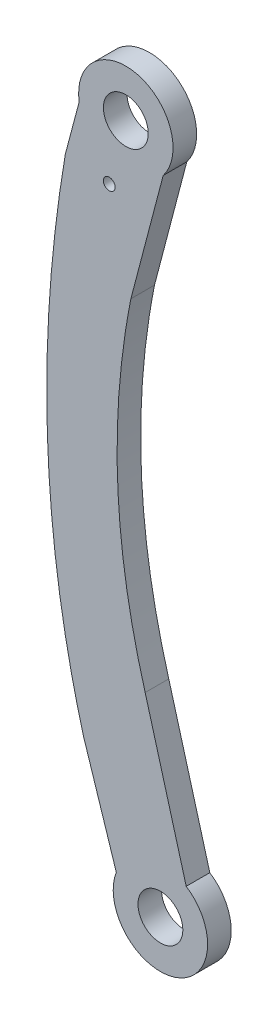
ISO-10303-21;
HEADER;
FILE_DESCRIPTION(('STEP AP214'),'2;1');
FILE_NAME('part.step','',(''),(''),'','','');
FILE_SCHEMA(('AUTOMOTIVE_DESIGN { 1 0 10303 214 1 1 1 1 }'));
ENDSEC;
DATA;
#1=APPLICATION_CONTEXT('core data for automotive mechanical design processes');
#2=APPLICATION_PROTOCOL_DEFINITION('international standard','automotive_design',2000,#1);
#3=PRODUCT_CONTEXT('',#1,'mechanical');
#4=PRODUCT('Part','Part','',(#3));
#5=PRODUCT_RELATED_PRODUCT_CATEGORY('part','',(#4));
#6=PRODUCT_DEFINITION_FORMATION('','',#4);
#7=PRODUCT_DEFINITION_CONTEXT('part definition',#1,'design');
#8=PRODUCT_DEFINITION('design','',#6,#7);
#9=PRODUCT_DEFINITION_SHAPE('','',#8);
#10=(LENGTH_UNIT() NAMED_UNIT(*) SI_UNIT(.MILLI.,.METRE.));
#11=(NAMED_UNIT(*) PLANE_ANGLE_UNIT() SI_UNIT($,.RADIAN.));
#12=(NAMED_UNIT(*) SI_UNIT($,.STERADIAN.) SOLID_ANGLE_UNIT());
#13=UNCERTAINTY_MEASURE_WITH_UNIT(LENGTH_MEASURE(1.E-05),#10,'distance_accuracy_value','');
#14=(GEOMETRIC_REPRESENTATION_CONTEXT(3) GLOBAL_UNCERTAINTY_ASSIGNED_CONTEXT((#13)) GLOBAL_UNIT_ASSIGNED_CONTEXT((#10,
#11,#12)) REPRESENTATION_CONTEXT('',''));
#15=CARTESIAN_POINT('',(0.,0.,0.));
#16=DIRECTION('',(0.,0.,1.));
#17=DIRECTION('',(1.,0.,0.));
#18=AXIS2_PLACEMENT_3D('',#15,#16,#17);
#19=CARTESIAN_POINT('',(-1.78802909142635,0.469897368259502,2.));
#20=DIRECTION('',(0.967159231454294,-0.254171243481122,0.));
#21=DIRECTION('',(0.254171243481122,0.967159231454294,0.));
#22=AXIS2_PLACEMENT_3D('',#19,#20,#21);
#23=PLANE('',#22);
#24=DIRECTION('',(-0.254171243481122,-0.967159231454294,0.));
#25=VECTOR('',#24,1.);
#26=CARTESIAN_POINT('',(-1.78802909142635,0.469897368259502,-2.));
#27=LINE('',#26,#25);
#28=CARTESIAN_POINT('',(0.470383738762236,9.06349272246381,-2.));
#29=VERTEX_POINT('',#28);
#30=CARTESIAN_POINT('',(-5.00419326786642,-11.7680837287156,-2.));
#31=VERTEX_POINT('',#30);
#32=EDGE_CURVE('E55',#29,#31,#27,.T.);
#33=ORIENTED_EDGE('',*,*,#32,.F.);
#34=DIRECTION('',(0.,0.,-1.));
#35=VECTOR('',#34,1.);
#36=CARTESIAN_POINT('',(0.47038373876223,9.0634927224638,2.));
#37=LINE('',#36,#35);
#38=CARTESIAN_POINT('',(0.470383738762236,9.06349272246381,2.));
#39=VERTEX_POINT('',#38);
#40=EDGE_CURVE('E50',#29,#39,#37,.F.);
#41=ORIENTED_EDGE('',*,*,#40,.T.);
#42=DIRECTION('',(-0.254171243481122,-0.967159231454294,0.));
#43=VECTOR('',#42,1.);
#44=CARTESIAN_POINT('',(-1.78802909142635,0.469897368259502,2.));
#45=LINE('',#44,#43);
#46=CARTESIAN_POINT('',(-5.00419326786642,-11.7680837287156,2.));
#47=VERTEX_POINT('',#46);
#48=EDGE_CURVE('E108',#39,#47,#45,.T.);
#49=ORIENTED_EDGE('',*,*,#48,.T.);
#50=DIRECTION('',(0.,0.,-1.));
#51=VECTOR('',#50,1.);
#52=CARTESIAN_POINT('',(-5.00419326786642,-11.7680837287156,2.));
#53=LINE('',#52,#51);
#54=EDGE_CURVE('E43',#47,#31,#53,.T.);
#55=ORIENTED_EDGE('',*,*,#54,.T.);
#56=EDGE_LOOP('',(#33,#41,#49,#55));
#57=FACE_BOUND('',#56,.T.);
#58=ADVANCED_FACE('F35',(#57),#23,.T.);
#59=CARTESIAN_POINT('',(-16.0185654022717,4.24957374531499,2.));
#60=DIRECTION('',(0.966565292689048,-0.256420621185064,0.));
#61=DIRECTION('',(0.256420621185064,0.966565292689048,0.));
#62=AXIS2_PLACEMENT_3D('',#59,#60,#61);
#63=PLANE('',#62);
#64=DIRECTION('',(0.,0.,-1.));
#65=VECTOR('',#64,1.);
#66=CARTESIAN_POINT('',(-13.7648884417375,12.7447014808224,2.));
#67=LINE('',#66,#65);
#68=CARTESIAN_POINT('',(-13.7648884417375,12.7447014808224,-2.));
#69=VERTEX_POINT('',#68);
#70=CARTESIAN_POINT('',(-13.7648884417375,12.7447014808224,2.));
#71=VERTEX_POINT('',#70);
#72=EDGE_CURVE('E99',#69,#71,#67,.F.);
#73=ORIENTED_EDGE('',*,*,#72,.F.);
#74=DIRECTION('',(-0.256420621185064,-0.966565292689048,0.));
#75=VECTOR('',#74,1.);
#76=CARTESIAN_POINT('',(-16.0185654022717,4.24957374531499,-2.));
#77=LINE('',#76,#75);
#78=CARTESIAN_POINT('',(-16.1090040902011,3.90866942777225,-2.));
#79=VERTEX_POINT('',#78);
#80=EDGE_CURVE('E270',#69,#79,#77,.T.);
#81=ORIENTED_EDGE('',*,*,#80,.T.);
#82=DIRECTION('',(0.,0.,-1.));
#83=VECTOR('',#82,1.);
#84=CARTESIAN_POINT('',(-16.1090040902011,3.90866942777225,2.));
#85=LINE('',#84,#83);
#86=CARTESIAN_POINT('',(-16.1090040902011,3.90866942777225,2.));
#87=VERTEX_POINT('',#86);
#88=EDGE_CURVE('E102',#87,#79,#85,.T.);
#89=ORIENTED_EDGE('',*,*,#88,.F.);
#90=DIRECTION('',(-0.256420621185064,-0.966565292689048,0.));
#91=VECTOR('',#90,1.);
#92=CARTESIAN_POINT('',(-16.0185654022717,4.24957374531499,2.));
#93=LINE('',#92,#91);
#94=EDGE_CURVE('E96',#71,#87,#93,.T.);
#95=ORIENTED_EDGE('',*,*,#94,.F.);
#96=EDGE_LOOP('',(#73,#81,#89,#95));
#97=FACE_BOUND('',#96,.T.);
#98=ADVANCED_FACE('F98',(#97),#63,.F.);
#99=CARTESIAN_POINT('',(-20.0645430802818,-5.59029489231509,2.));
#100=DIRECTION('',(0.963309485971728,0.268393059218909,0.));
#101=DIRECTION('',(-0.268393059218909,0.963309485971728,0.));
#102=AXIS2_PLACEMENT_3D('',#99,#100,#101);
#103=PLANE('',#102);
#104=DIRECTION('',(0.268393059218909,-0.963309485971728,0.));
#105=VECTOR('',#104,1.);
#106=CARTESIAN_POINT('',(-20.0645430802818,-5.59029489231509,2.));
#107=LINE('',#106,#105);
#108=CARTESIAN_POINT('',(-2.58265982047225,-68.3358220152404,2.));
#109=VERTEX_POINT('',#108);
#110=CARTESIAN_POINT('',(4.37302791285559,-93.3009980688685,2.));
#111=VERTEX_POINT('',#110);
#112=EDGE_CURVE('E139',#109,#111,#107,.T.);
#113=ORIENTED_EDGE('',*,*,#112,.T.);
#114=DIRECTION('',(0.,0.,-1.));
#115=VECTOR('',#114,1.);
#116=CARTESIAN_POINT('',(4.37302791285558,-93.3009980688685,2.));
#117=LINE('',#116,#115);
#118=CARTESIAN_POINT('',(4.37302791285559,-93.3009980688685,-2.));
#119=VERTEX_POINT('',#118);
#120=EDGE_CURVE('E133',#111,#119,#117,.T.);
#121=ORIENTED_EDGE('',*,*,#120,.T.);
#122=DIRECTION('',(0.268393059218909,-0.963309485971728,0.));
#123=VECTOR('',#122,1.);
#124=CARTESIAN_POINT('',(-20.0645430802818,-5.59029489231509,-2.));
#125=LINE('',#124,#123);
#126=CARTESIAN_POINT('',(-2.58265982047225,-68.3358220152404,-2.));
#127=VERTEX_POINT('',#126);
#128=EDGE_CURVE('E258',#127,#119,#125,.T.);
#129=ORIENTED_EDGE('',*,*,#128,.F.);
#130=DIRECTION('',(0.,0.,-1.));
#131=VECTOR('',#130,1.);
#132=CARTESIAN_POINT('',(-2.58265982047225,-68.3358220152404,2.));
#133=LINE('',#132,#131);
#134=EDGE_CURVE('E11',#109,#127,#133,.T.);
#135=ORIENTED_EDGE('',*,*,#134,.F.);
#136=EDGE_LOOP('',(#113,#121,#129,#135));
#137=FACE_BOUND('',#136,.T.);
#138=ADVANCED_FACE('F158',(#137),#103,.T.);
#139=CARTESIAN_POINT('',(-35.2130828693191,-11.3875475888114,2.));
#140=DIRECTION('',(-0.951483449346962,-0.307699927882356,0.));
#141=DIRECTION('',(0.307699927882356,-0.951483449346962,0.));
#142=AXIS2_PLACEMENT_3D('',#139,#140,#141);
#143=PLANE('',#142);
#144=DIRECTION('',(-0.307699927882356,0.951483449346962,0.));
#145=VECTOR('',#144,1.);
#146=CARTESIAN_POINT('',(-35.2130828693191,-11.3875475888114,-2.));
#147=LINE('',#146,#145);
#148=CARTESIAN_POINT('',(-7.47689148061421,-97.1546364402668,-2.));
#149=VERTEX_POINT('',#148);
#150=CARTESIAN_POINT('',(-13.0270199851385,-79.9922813817283,-2.));
#151=VERTEX_POINT('',#150);
#152=EDGE_CURVE('E277',#149,#151,#147,.T.);
#153=ORIENTED_EDGE('',*,*,#152,.F.);
#154=DIRECTION('',(0.,0.,-1.));
#155=VECTOR('',#154,1.);
#156=CARTESIAN_POINT('',(-7.47689148061421,-97.1546364402668,2.));
#157=LINE('',#156,#155);
#158=CARTESIAN_POINT('',(-7.47689148061421,-97.1546364402668,2.));
#159=VERTEX_POINT('',#158);
#160=EDGE_CURVE('E129',#149,#159,#157,.F.);
#161=ORIENTED_EDGE('',*,*,#160,.T.);
#162=DIRECTION('',(-0.307699927882356,0.951483449346962,0.));
#163=VECTOR('',#162,1.);
#164=CARTESIAN_POINT('',(-35.2130828693191,-11.3875475888114,2.));
#165=LINE('',#164,#163);
#166=CARTESIAN_POINT('',(-13.0270199851385,-79.9922813817283,2.));
#167=VERTEX_POINT('',#166);
#168=EDGE_CURVE('E244',#159,#167,#165,.T.);
#169=ORIENTED_EDGE('',*,*,#168,.T.);
#170=DIRECTION('',(0.,0.,-1.));
#171=VECTOR('',#170,1.);
#172=CARTESIAN_POINT('',(-13.0270199851385,-79.9922813817283,2.));
#173=LINE('',#172,#171);
#174=EDGE_CURVE('E255',#167,#151,#173,.T.);
#175=ORIENTED_EDGE('',*,*,#174,.T.);
#176=EDGE_LOOP('',(#153,#161,#169,#175));
#177=FACE_BOUND('',#176,.T.);
#178=ADVANCED_FACE('F155',(#177),#143,.T.);
#179=CARTESIAN_POINT('',(-2.58265982047225,-68.3358220152404,2.));
#180=CARTESIAN_POINT('',(-10.6774419006202,-40.319817229844,2.));
#181=CARTESIAN_POINT('',(-5.00419326786643,-11.7680837287156,2.));
#182=B_SPLINE_CURVE_WITH_KNOTS('',2,(#179,#180,#181),.UNSPECIFIED.,.F.,.F.,(3,3),(0.,1.),.UNSPECIFIED.);
#183=DIRECTION('',(0.,0.,-1.));
#184=VECTOR('',#183,1.);
#185=SURFACE_OF_LINEAR_EXTRUSION('',#182,#184);
#186=CARTESIAN_POINT('',(-2.58265982047225,-68.3358220152404,-2.));
#187=CARTESIAN_POINT('',(-10.6774419006202,-40.319817229844,-2.));
#188=CARTESIAN_POINT('',(-5.00419326786643,-11.7680837287156,-2.));
#189=B_SPLINE_CURVE_WITH_KNOTS('',2,(#186,#187,#188),.UNSPECIFIED.,.F.,.F.,(3,3),(0.,1.),.UNSPECIFIED.);
#190=EDGE_CURVE('E261',#127,#31,#189,.T.);
#191=ORIENTED_EDGE('',*,*,#190,.T.);
#192=ORIENTED_EDGE('',*,*,#54,.F.);
#193=EDGE_CURVE('E142',#109,#47,#182,.T.);
#194=ORIENTED_EDGE('',*,*,#193,.F.);
#195=ORIENTED_EDGE('',*,*,#134,.T.);
#196=EDGE_LOOP('',(#191,#192,#194,#195));
#197=FACE_BOUND('',#196,.T.);
#198=ADVANCED_FACE('F151',(#197),#185,.F.);
#199=CARTESIAN_POINT('',(-16.1090040902011,3.90866942777225,2.));
#200=CARTESIAN_POINT('',(-19.3777168344272,-15.2425089610822,2.));
#201=CARTESIAN_POINT('',(-20.6460852707623,-43.8019233774835,2.));
#202=CARTESIAN_POINT('',(-15.357286602361,-71.5641241934527,2.));
#203=CARTESIAN_POINT('',(-13.0270199851385,-79.9922813817283,2.));
#204=B_SPLINE_CURVE_WITH_KNOTS('',3,(#199,#200,#201,#202,#203),.UNSPECIFIED.,.F.,.F.,(4,1,4),
(0.,0.615830564355695,0.89175385418048),.UNSPECIFIED.);
#205=DIRECTION('',(0.,0.,-1.));
#206=VECTOR('',#205,1.);
#207=SURFACE_OF_LINEAR_EXTRUSION('',#204,#206);
#208=CARTESIAN_POINT('',(-16.1090040902011,3.90866942777225,-2.));
#209=CARTESIAN_POINT('',(-19.3777168344272,-15.2425089610822,-2.));
#210=CARTESIAN_POINT('',(-20.6460852707623,-43.8019233774835,-2.));
#211=CARTESIAN_POINT('',(-15.357286602361,-71.5641241934527,-2.));
#212=CARTESIAN_POINT('',(-13.0270199851385,-79.9922813817283,-2.));
#213=B_SPLINE_CURVE_WITH_KNOTS('',3,(#208,#209,#210,#211,#212),.UNSPECIFIED.,.F.,.F.,(4,1,4),
(0.,0.615830564355695,0.89175385418048),.UNSPECIFIED.);
#214=EDGE_CURVE('E272',#79,#151,#213,.T.);
#215=ORIENTED_EDGE('',*,*,#214,.T.);
#216=ORIENTED_EDGE('',*,*,#174,.F.);
#217=EDGE_CURVE('E107',#87,#167,#204,.T.);
#218=ORIENTED_EDGE('',*,*,#217,.F.);
#219=ORIENTED_EDGE('',*,*,#88,.T.);
#220=EDGE_LOOP('',(#215,#216,#218,#219));
#221=FACE_BOUND('',#220,.T.);
#222=ADVANCED_FACE('F154',(#221),#207,.F.);
#223=CARTESIAN_POINT('',(-5.85746323449391,13.9582197509153,2.));
#224=DIRECTION('',(0.,0.,-1.));
#225=DIRECTION('',(-1.,0.,0.));
#226=AXIS2_PLACEMENT_3D('',#223,#224,#225);
#227=CYLINDRICAL_SURFACE('',#226,3.8);
#228=CARTESIAN_POINT('',(-5.85746323449391,13.9582197509153,2.));
#229=DIRECTION('',(0.,0.,1.));
#230=DIRECTION('',(1.,0.,0.));
#231=AXIS2_PLACEMENT_3D('',#228,#229,#230);
#232=CIRCLE('',#231,3.8);
#233=CARTESIAN_POINT('',(-2.05746323449391,13.9582197509153,2.));
#234=VERTEX_POINT('',#233);
#235=EDGE_CURVE('E249',#234,#234,#232,.T.);
#236=ORIENTED_EDGE('',*,*,#235,.T.);
#237=EDGE_LOOP('',(#236));
#238=FACE_BOUND('',#237,.T.);
#239=CARTESIAN_POINT('',(-5.85746323449391,13.9582197509153,-2.));
#240=DIRECTION('',(0.,0.,1.));
#241=DIRECTION('',(1.,0.,0.));
#242=AXIS2_PLACEMENT_3D('',#239,#240,#241);
#243=CIRCLE('',#242,3.8);
#244=CARTESIAN_POINT('',(-2.05746323449391,13.9582197509153,-2.));
#245=VERTEX_POINT('',#244);
#246=EDGE_CURVE('E282',#245,#245,#243,.T.);
#247=ORIENTED_EDGE('',*,*,#246,.F.);
#248=EDGE_LOOP('',(#247));
#249=FACE_BOUND('',#248,.T.);
#250=ADVANCED_FACE('F233',(#238,#249),#227,.F.);
#251=CARTESIAN_POINT('',(-8.67203901594341,3.2483477044386,2.));
#252=DIRECTION('',(0.,0.,-1.));
#253=DIRECTION('',(-1.,0.,0.));
#254=AXIS2_PLACEMENT_3D('',#251,#252,#253);
#255=CYLINDRICAL_SURFACE('',#254,1.);
#256=CARTESIAN_POINT('',(-8.67203901594341,3.2483477044386,2.));
#257=DIRECTION('',(0.,0.,1.));
#258=DIRECTION('',(1.,0.,0.));
#259=AXIS2_PLACEMENT_3D('',#256,#257,#258);
#260=CIRCLE('',#259,1.);
#261=CARTESIAN_POINT('',(-7.67203901594341,3.2483477044386,2.));
#262=VERTEX_POINT('',#261);
#263=EDGE_CURVE('E136',#262,#262,#260,.T.);
#264=ORIENTED_EDGE('',*,*,#263,.T.);
#265=EDGE_LOOP('',(#264));
#266=FACE_BOUND('',#265,.T.);
#267=CARTESIAN_POINT('',(-8.67203901594341,3.2483477044386,-2.));
#268=DIRECTION('',(0.,0.,1.));
#269=DIRECTION('',(1.,0.,0.));
#270=AXIS2_PLACEMENT_3D('',#267,#268,#269);
#271=CIRCLE('',#270,1.);
#272=CARTESIAN_POINT('',(-7.67203901594341,3.2483477044386,-2.));
#273=VERTEX_POINT('',#272);
#274=EDGE_CURVE('E135',#273,#273,#271,.T.);
#275=ORIENTED_EDGE('',*,*,#274,.F.);
#276=EDGE_LOOP('',(#275));
#277=FACE_BOUND('',#276,.T.);
#278=ADVANCED_FACE('F37',(#266,#277),#255,.F.);
#279=CARTESIAN_POINT('',(1.40512601554121E-12,-100.000000000007,2.));
#280=DIRECTION('',(0.,0.,-1.));
#281=DIRECTION('',(-1.,0.,0.));
#282=AXIS2_PLACEMENT_3D('',#279,#280,#281);
#283=CYLINDRICAL_SURFACE('',#282,3.8);
#284=CARTESIAN_POINT('',(1.40512601554121E-12,-100.000000000007,2.));
#285=DIRECTION('',(0.,0.,1.));
#286=DIRECTION('',(1.,0.,0.));
#287=AXIS2_PLACEMENT_3D('',#284,#285,#286);
#288=CIRCLE('',#287,3.8);
#289=CARTESIAN_POINT('',(3.8000000000014,-100.000000000007,2.));
#290=VERTEX_POINT('',#289);
#291=EDGE_CURVE('E252',#290,#290,#288,.T.);
#292=ORIENTED_EDGE('',*,*,#291,.T.);
#293=EDGE_LOOP('',(#292));
#294=FACE_BOUND('',#293,.T.);
#295=CARTESIAN_POINT('',(1.40512601554121E-12,-100.000000000007,-2.));
#296=DIRECTION('',(0.,0.,1.));
#297=DIRECTION('',(1.,0.,0.));
#298=AXIS2_PLACEMENT_3D('',#295,#296,#297);
#299=CIRCLE('',#298,3.8);
#300=CARTESIAN_POINT('',(3.8000000000014,-100.000000000007,-2.));
#301=VERTEX_POINT('',#300);
#302=EDGE_CURVE('E140',#301,#301,#299,.T.);
#303=ORIENTED_EDGE('',*,*,#302,.F.);
#304=EDGE_LOOP('',(#303));
#305=FACE_BOUND('',#304,.T.);
#306=ADVANCED_FACE('F196',(#294,#305),#283,.F.);
#307=CARTESIAN_POINT('',(0.,0.,2.));
#308=DIRECTION('',(0.,0.,1.));
#309=DIRECTION('',(1.,0.,0.));
#310=AXIS2_PLACEMENT_3D('',#307,#308,#309);
#311=PLANE('',#310);
#312=ORIENTED_EDGE('',*,*,#48,.F.);
#313=CARTESIAN_POINT('',(-5.85746323449391,13.9582197509153,2.));
#314=DIRECTION('',(0.,0.,1.));
#315=DIRECTION('',(1.,0.,0.));
#316=AXIS2_PLACEMENT_3D('',#313,#314,#315);
#317=CIRCLE('',#316,8.);
#318=EDGE_CURVE('E114',#39,#71,#317,.T.);
#319=ORIENTED_EDGE('',*,*,#318,.T.);
#320=ORIENTED_EDGE('',*,*,#94,.T.);
#321=ORIENTED_EDGE('',*,*,#217,.T.);
#322=ORIENTED_EDGE('',*,*,#168,.F.);
#323=CARTESIAN_POINT('',(1.40512601554121E-12,-100.000000000007,2.));
#324=DIRECTION('',(0.,0.,1.));
#325=DIRECTION('',(1.,0.,0.));
#326=AXIS2_PLACEMENT_3D('',#323,#324,#325);
#327=CIRCLE('',#326,8.);
#328=EDGE_CURVE('E126',#159,#111,#327,.T.);
#329=ORIENTED_EDGE('',*,*,#328,.T.);
#330=ORIENTED_EDGE('',*,*,#112,.F.);
#331=ORIENTED_EDGE('',*,*,#193,.T.);
#332=EDGE_LOOP('',(#312,#319,#320,#321,#322,#329,#330,#331));
#333=FACE_BOUND('',#332,.T.);
#334=ORIENTED_EDGE('',*,*,#235,.F.);
#335=EDGE_LOOP('',(#334));
#336=FACE_BOUND('',#335,.T.);
#337=ORIENTED_EDGE('',*,*,#291,.F.);
#338=EDGE_LOOP('',(#337));
#339=FACE_BOUND('',#338,.T.);
#340=ORIENTED_EDGE('',*,*,#263,.F.);
#341=EDGE_LOOP('',(#340));
#342=FACE_BOUND('',#341,.T.);
#343=ADVANCED_FACE('F118',(#333,#336,#339,#342),#311,.T.);
#344=CARTESIAN_POINT('',(0.,0.,-2.));
#345=DIRECTION('',(0.,0.,1.));
#346=DIRECTION('',(1.,0.,0.));
#347=AXIS2_PLACEMENT_3D('',#344,#345,#346);
#348=PLANE('',#347);
#349=CARTESIAN_POINT('',(-5.85746323449391,13.9582197509153,-2.));
#350=DIRECTION('',(0.,0.,1.));
#351=DIRECTION('',(1.,0.,0.));
#352=AXIS2_PLACEMENT_3D('',#349,#350,#351);
#353=CIRCLE('',#352,8.);
#354=EDGE_CURVE('E116',#29,#69,#353,.T.);
#355=ORIENTED_EDGE('',*,*,#354,.F.);
#356=ORIENTED_EDGE('',*,*,#32,.T.);
#357=ORIENTED_EDGE('',*,*,#190,.F.);
#358=ORIENTED_EDGE('',*,*,#128,.T.);
#359=CARTESIAN_POINT('',(1.40512601554121E-12,-100.000000000007,-2.));
#360=DIRECTION('',(0.,0.,1.));
#361=DIRECTION('',(1.,0.,0.));
#362=AXIS2_PLACEMENT_3D('',#359,#360,#361);
#363=CIRCLE('',#362,8.);
#364=EDGE_CURVE('E125',#149,#119,#363,.T.);
#365=ORIENTED_EDGE('',*,*,#364,.F.);
#366=ORIENTED_EDGE('',*,*,#152,.T.);
#367=ORIENTED_EDGE('',*,*,#214,.F.);
#368=ORIENTED_EDGE('',*,*,#80,.F.);
#369=EDGE_LOOP('',(#355,#356,#357,#358,#365,#366,#367,#368));
#370=FACE_BOUND('',#369,.T.);
#371=ORIENTED_EDGE('',*,*,#246,.T.);
#372=EDGE_LOOP('',(#371));
#373=FACE_BOUND('',#372,.T.);
#374=ORIENTED_EDGE('',*,*,#302,.T.);
#375=EDGE_LOOP('',(#374));
#376=FACE_BOUND('',#375,.T.);
#377=ORIENTED_EDGE('',*,*,#274,.T.);
#378=EDGE_LOOP('',(#377));
#379=FACE_BOUND('',#378,.T.);
#380=ADVANCED_FACE('F195',(#370,#373,#376,#379),#348,.F.);
#381=CARTESIAN_POINT('',(1.40512601554121E-12,-100.000000000007,2.));
#382=DIRECTION('',(0.,0.,-1.));
#383=DIRECTION('',(-1.,0.,0.));
#384=AXIS2_PLACEMENT_3D('',#381,#382,#383);
#385=CYLINDRICAL_SURFACE('',#384,8.);
#386=ORIENTED_EDGE('',*,*,#120,.F.);
#387=ORIENTED_EDGE('',*,*,#328,.F.);
#388=ORIENTED_EDGE('',*,*,#160,.F.);
#389=ORIENTED_EDGE('',*,*,#364,.T.);
#390=EDGE_LOOP('',(#386,#387,#388,#389));
#391=FACE_BOUND('',#390,.T.);
#392=ADVANCED_FACE('F208',(#391),#385,.T.);
#393=CARTESIAN_POINT('',(-5.85746323449391,13.9582197509153,2.));
#394=DIRECTION('',(0.,0.,-1.));
#395=DIRECTION('',(-1.,0.,0.));
#396=AXIS2_PLACEMENT_3D('',#393,#394,#395);
#397=CYLINDRICAL_SURFACE('',#396,8.);
#398=ORIENTED_EDGE('',*,*,#40,.F.);
#399=ORIENTED_EDGE('',*,*,#354,.T.);
#400=ORIENTED_EDGE('',*,*,#72,.T.);
#401=ORIENTED_EDGE('',*,*,#318,.F.);
#402=EDGE_LOOP('',(#398,#399,#400,#401));
#403=FACE_BOUND('',#402,.T.);
#404=ADVANCED_FACE('F113',(#403),#397,.T.);
#405=CLOSED_SHELL('',(#58,#98,#138,#178,#198,#222,#250,#278,#306,#343,#380,#392,#404));
#406=MANIFOLD_SOLID_BREP('B2',#405);
#407=ADVANCED_BREP_SHAPE_REPRESENTATION('',(#18,#406),#14);
#408=SHAPE_DEFINITION_REPRESENTATION(#9,#407);
ENDSEC;
END-ISO-10303-21;
